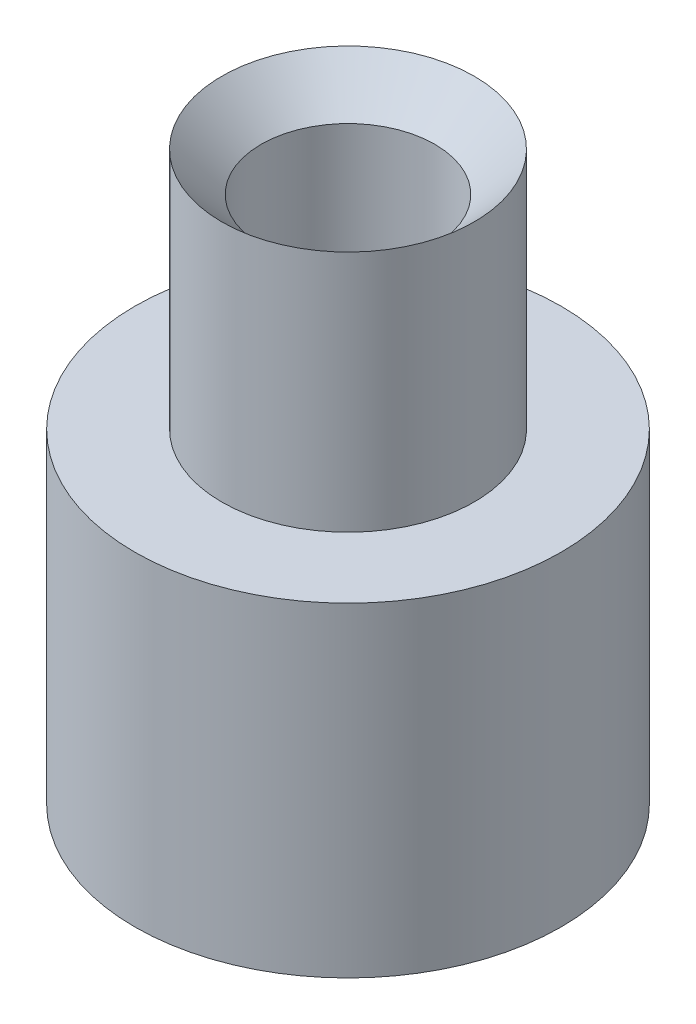
ISO-10303-21;
HEADER;
FILE_DESCRIPTION(('STEP AP214'),'2;1');
FILE_NAME('part.step','',(''),(''),'','','');
FILE_SCHEMA(('AUTOMOTIVE_DESIGN { 1 0 10303 214 1 1 1 1 }'));
ENDSEC;
DATA;
#1=APPLICATION_CONTEXT('core data for automotive mechanical design processes');
#2=APPLICATION_PROTOCOL_DEFINITION('international standard','automotive_design',2000,#1);
#3=PRODUCT_CONTEXT('',#1,'mechanical');
#4=PRODUCT('Part','Part','',(#3));
#5=PRODUCT_RELATED_PRODUCT_CATEGORY('part','',(#4));
#6=PRODUCT_DEFINITION_FORMATION('','',#4);
#7=PRODUCT_DEFINITION_CONTEXT('part definition',#1,'design');
#8=PRODUCT_DEFINITION('design','',#6,#7);
#9=PRODUCT_DEFINITION_SHAPE('','',#8);
#10=(LENGTH_UNIT() NAMED_UNIT(*) SI_UNIT(.MILLI.,.METRE.));
#11=(NAMED_UNIT(*) PLANE_ANGLE_UNIT() SI_UNIT($,.RADIAN.));
#12=(NAMED_UNIT(*) SI_UNIT($,.STERADIAN.) SOLID_ANGLE_UNIT());
#13=UNCERTAINTY_MEASURE_WITH_UNIT(LENGTH_MEASURE(1.E-05),#10,'distance_accuracy_value','');
#14=(GEOMETRIC_REPRESENTATION_CONTEXT(3) GLOBAL_UNCERTAINTY_ASSIGNED_CONTEXT((#13)) GLOBAL_UNIT_ASSIGNED_CONTEXT((#10,
#11,#12)) REPRESENTATION_CONTEXT('',''));
#15=CARTESIAN_POINT('',(0.,0.,0.));
#16=DIRECTION('',(0.,0.,1.));
#17=DIRECTION('',(1.,0.,0.));
#18=AXIS2_PLACEMENT_3D('',#15,#16,#17);
#19=CARTESIAN_POINT('',(0.,9.9,0.));
#20=DIRECTION('',(0.,1.,0.));
#21=DIRECTION('',(0.,0.,1.));
#22=AXIS2_PLACEMENT_3D('',#19,#20,#21);
#23=PLANE('',#22);
#24=CARTESIAN_POINT('',(0.,9.9,0.));
#25=DIRECTION('',(0.,1.,0.));
#26=DIRECTION('',(0.,0.,1.));
#27=AXIS2_PLACEMENT_3D('',#24,#25,#26);
#28=CIRCLE('',#27,6.5);
#29=CARTESIAN_POINT('',(0.,9.9,-6.5));
#30=VERTEX_POINT('',#29);
#31=EDGE_CURVE('E50',#30,#30,#28,.T.);
#32=ORIENTED_EDGE('',*,*,#31,.T.);
#33=EDGE_LOOP('',(#32));
#34=FACE_BOUND('',#33,.T.);
#35=CARTESIAN_POINT('',(0.,9.9,0.));
#36=DIRECTION('',(0.,1.,0.));
#37=DIRECTION('',(0.,0.,1.));
#38=AXIS2_PLACEMENT_3D('',#35,#36,#37);
#39=CIRCLE('',#38,3.85);
#40=CARTESIAN_POINT('',(0.,9.9,3.85));
#41=VERTEX_POINT('',#40);
#42=EDGE_CURVE('E65',#41,#41,#39,.T.);
#43=ORIENTED_EDGE('',*,*,#42,.F.);
#44=EDGE_LOOP('',(#43));
#45=FACE_BOUND('',#44,.T.);
#46=ADVANCED_FACE('F37',(#34,#45),#23,.T.);
#47=CARTESIAN_POINT('',(0.,0.,0.));
#48=DIRECTION('',(0.,1.,0.));
#49=DIRECTION('',(0.,0.,1.));
#50=AXIS2_PLACEMENT_3D('',#47,#48,#49);
#51=PLANE('',#50);
#52=CARTESIAN_POINT('',(0.,0.,0.));
#53=DIRECTION('',(0.,1.,0.));
#54=DIRECTION('',(0.,0.,1.));
#55=AXIS2_PLACEMENT_3D('',#52,#53,#54);
#56=CIRCLE('',#55,6.5);
#57=CARTESIAN_POINT('',(0.,0.,-6.5));
#58=VERTEX_POINT('',#57);
#59=EDGE_CURVE('E55',#58,#58,#56,.T.);
#60=ORIENTED_EDGE('',*,*,#59,.F.);
#61=EDGE_LOOP('',(#60));
#62=FACE_BOUND('',#61,.T.);
#63=CARTESIAN_POINT('',(0.,0.,0.));
#64=DIRECTION('',(0.,1.,0.));
#65=DIRECTION('',(0.,0.,1.));
#66=AXIS2_PLACEMENT_3D('',#63,#64,#65);
#67=CIRCLE('',#66,2.65);
#68=CARTESIAN_POINT('',(0.,0.,-2.65));
#69=VERTEX_POINT('',#68);
#70=EDGE_CURVE('E60',#69,#69,#67,.T.);
#71=ORIENTED_EDGE('',*,*,#70,.T.);
#72=EDGE_LOOP('',(#71));
#73=FACE_BOUND('',#72,.T.);
#74=ADVANCED_FACE('F73',(#62,#73),#51,.F.);
#75=CARTESIAN_POINT('',(0.,9.9,0.));
#76=DIRECTION('',(0.,-1.,0.));
#77=DIRECTION('',(0.,0.,-1.));
#78=AXIS2_PLACEMENT_3D('',#75,#76,#77);
#79=CYLINDRICAL_SURFACE('',#78,6.5);
#80=CARTESIAN_POINT('',(0.,9.9,-6.5));
#81=CARTESIAN_POINT('',(0.,9.796875,-6.5));
#82=CARTESIAN_POINT('',(0.,9.69375,-6.5));
#83=CARTESIAN_POINT('',(0.,9.4875,-6.5));
#84=CARTESIAN_POINT('',(0.,9.384375,-6.5));
#85=CARTESIAN_POINT('',(0.,9.178125,-6.5));
#86=CARTESIAN_POINT('',(0.,9.075,-6.5));
#87=CARTESIAN_POINT('',(0.,8.86875,-6.5));
#88=CARTESIAN_POINT('',(0.,8.765625,-6.5));
#89=CARTESIAN_POINT('',(0.,8.559375,-6.5));
#90=CARTESIAN_POINT('',(0.,8.45625,-6.5));
#91=CARTESIAN_POINT('',(0.,8.25,-6.5));
#92=CARTESIAN_POINT('',(0.,8.146875,-6.5));
#93=CARTESIAN_POINT('',(0.,7.940625,-6.5));
#94=CARTESIAN_POINT('',(0.,7.8375,-6.5));
#95=CARTESIAN_POINT('',(0.,7.63125,-6.5));
#96=CARTESIAN_POINT('',(0.,7.528125,-6.5));
#97=CARTESIAN_POINT('',(0.,7.321875,-6.5));
#98=CARTESIAN_POINT('',(0.,7.21875,-6.5));
#99=CARTESIAN_POINT('',(0.,7.0125,-6.5));
#100=CARTESIAN_POINT('',(0.,6.909375,-6.5));
#101=CARTESIAN_POINT('',(0.,6.703125,-6.5));
#102=CARTESIAN_POINT('',(0.,6.6,-6.5));
#103=CARTESIAN_POINT('',(0.,6.39375,-6.5));
#104=CARTESIAN_POINT('',(0.,6.290625,-6.5));
#105=CARTESIAN_POINT('',(0.,6.084375,-6.5));
#106=CARTESIAN_POINT('',(0.,5.98125,-6.5));
#107=CARTESIAN_POINT('',(0.,5.775,-6.5));
#108=CARTESIAN_POINT('',(0.,5.671875,-6.5));
#109=CARTESIAN_POINT('',(0.,5.465625,-6.5));
#110=CARTESIAN_POINT('',(0.,5.3625,-6.5));
#111=CARTESIAN_POINT('',(0.,5.15625,-6.5));
#112=CARTESIAN_POINT('',(0.,5.053125,-6.5));
#113=CARTESIAN_POINT('',(0.,4.846875,-6.5));
#114=CARTESIAN_POINT('',(0.,4.74375,-6.5));
#115=CARTESIAN_POINT('',(0.,4.5375,-6.5));
#116=CARTESIAN_POINT('',(0.,4.434375,-6.5));
#117=CARTESIAN_POINT('',(0.,4.228125,-6.5));
#118=CARTESIAN_POINT('',(0.,4.125,-6.5));
#119=CARTESIAN_POINT('',(0.,3.91875,-6.5));
#120=CARTESIAN_POINT('',(0.,3.815625,-6.5));
#121=CARTESIAN_POINT('',(0.,3.609375,-6.5));
#122=CARTESIAN_POINT('',(0.,3.50625,-6.5));
#123=CARTESIAN_POINT('',(0.,3.3,-6.5));
#124=CARTESIAN_POINT('',(0.,3.196875,-6.5));
#125=CARTESIAN_POINT('',(0.,2.990625,-6.5));
#126=CARTESIAN_POINT('',(0.,2.8875,-6.5));
#127=CARTESIAN_POINT('',(0.,2.68125,-6.5));
#128=CARTESIAN_POINT('',(0.,2.578125,-6.5));
#129=CARTESIAN_POINT('',(0.,2.371875,-6.5));
#130=CARTESIAN_POINT('',(0.,2.26875,-6.5));
#131=CARTESIAN_POINT('',(0.,2.0625,-6.5));
#132=CARTESIAN_POINT('',(0.,1.959375,-6.5));
#133=CARTESIAN_POINT('',(0.,1.753125,-6.5));
#134=CARTESIAN_POINT('',(0.,1.65,-6.5));
#135=CARTESIAN_POINT('',(0.,1.44375,-6.5));
#136=CARTESIAN_POINT('',(0.,1.340625,-6.5));
#137=CARTESIAN_POINT('',(0.,1.134375,-6.5));
#138=CARTESIAN_POINT('',(0.,1.03125,-6.5));
#139=CARTESIAN_POINT('',(0.,0.825,-6.5));
#140=CARTESIAN_POINT('',(0.,0.721875,-6.5));
#141=CARTESIAN_POINT('',(0.,0.515625,-6.5));
#142=CARTESIAN_POINT('',(0.,0.4125,-6.5));
#143=CARTESIAN_POINT('',(0.,0.20625,-6.5));
#144=CARTESIAN_POINT('',(0.,0.103125,-6.5));
#145=CARTESIAN_POINT('',(0.,0.,-6.5));
#146=B_SPLINE_CURVE_WITH_KNOTS('',3,(#80,#81,#82,#83,#84,#85,#86,#87,#88,#89,#90,#91,#92,#93,
#94,#95,#96,#97,#98,#99,#100,#101,#102,#103,#104,#105,#106,#107,#108,#109,#110,#111,#112,#113,
#114,#115,#116,#117,#118,#119,#120,#121,#122,#123,#124,#125,#126,#127,#128,#129,#130,#131,#132,
#133,#134,#135,#136,#137,#138,#139,#140,#141,#142,#143,#144,#145),.UNSPECIFIED.,.F.,.F.,(4,2,2,
2,2,2,2,2,2,2,2,2,2,2,2,2,2,2,2,2,2,2,2,2,2,2,2,2,2,2,2,2,4),(0.,0.309374999999999,
0.618749999999999,0.928124999999998,1.2375,1.546875,1.85625,2.165625,2.475,2.784375,3.09375,
3.403125,3.7125,4.021875,4.33125,4.640625,4.95,5.259375,5.56875,5.878125,6.1875,6.496875,
6.80625,7.115625,7.425,7.734375,8.04375,8.353125,8.6625,8.971875,9.28125,9.590625,9.9),.UNSPECIFIED.);
#147=EDGE_CURVE('BSEAM79',#30,#58,#146,.T.);
#148=ORIENTED_EDGE('',*,*,#31,.F.);
#149=ORIENTED_EDGE('',*,*,#59,.T.);
#150=ORIENTED_EDGE('',*,*,#147,.T.);
#151=ORIENTED_EDGE('',*,*,#147,.F.);
#152=EDGE_LOOP('',(#148,#150,#149,#151));
#153=FACE_BOUND('',#152,.T.);
#154=ADVANCED_FACE('F79',(#153),#79,.T.);
#155=CARTESIAN_POINT('',(0.,9.9,0.));
#156=DIRECTION('',(0.,-1.,0.));
#157=DIRECTION('',(0.,0.,-1.));
#158=AXIS2_PLACEMENT_3D('',#155,#156,#157);
#159=CYLINDRICAL_SURFACE('',#158,2.65);
#160=CARTESIAN_POINT('',(0.,16.1,0.));
#161=DIRECTION('',(0.,1.,0.));
#162=DIRECTION('',(0.,0.,1.));
#163=AXIS2_PLACEMENT_3D('',#160,#161,#162);
#164=CIRCLE('',#163,2.65);
#165=CARTESIAN_POINT('',(0.,16.1,-2.65));
#166=VERTEX_POINT('',#165);
#167=EDGE_CURVE('E45',#166,#166,#164,.T.);
#168=CARTESIAN_POINT('',(0.,16.1,-2.65));
#169=CARTESIAN_POINT('',(0.,15.9322916666666,-2.65));
#170=CARTESIAN_POINT('',(0.,15.7645833333333,-2.65));
#171=CARTESIAN_POINT('',(0.,15.4291666666666,-2.65));
#172=CARTESIAN_POINT('',(0.,15.2614583333333,-2.65));
#173=CARTESIAN_POINT('',(0.,14.9260416666666,-2.65));
#174=CARTESIAN_POINT('',(0.,14.7583333333333,-2.65));
#175=CARTESIAN_POINT('',(0.,14.4229166666666,-2.65));
#176=CARTESIAN_POINT('',(0.,14.2552083333333,-2.65));
#177=CARTESIAN_POINT('',(0.,13.9197916666666,-2.65));
#178=CARTESIAN_POINT('',(0.,13.7520833333333,-2.65));
#179=CARTESIAN_POINT('',(0.,13.4166666666666,-2.65));
#180=CARTESIAN_POINT('',(0.,13.2489583333333,-2.65));
#181=CARTESIAN_POINT('',(0.,12.9135416666666,-2.65));
#182=CARTESIAN_POINT('',(0.,12.7458333333333,-2.65));
#183=CARTESIAN_POINT('',(0.,12.4104166666666,-2.65));
#184=CARTESIAN_POINT('',(0.,12.2427083333333,-2.65));
#185=CARTESIAN_POINT('',(0.,11.9072916666666,-2.65));
#186=CARTESIAN_POINT('',(0.,11.7395833333333,-2.65));
#187=CARTESIAN_POINT('',(0.,11.4041666666667,-2.65));
#188=CARTESIAN_POINT('',(0.,11.2364583333333,-2.65));
#189=CARTESIAN_POINT('',(0.,10.9010416666667,-2.65));
#190=CARTESIAN_POINT('',(0.,10.7333333333333,-2.65));
#191=CARTESIAN_POINT('',(0.,10.3979166666667,-2.65));
#192=CARTESIAN_POINT('',(0.,10.2302083333333,-2.65));
#193=CARTESIAN_POINT('',(0.,9.89479166666665,-2.65));
#194=CARTESIAN_POINT('',(0.,9.72708333333332,-2.65));
#195=CARTESIAN_POINT('',(0.,9.39166666666665,-2.65));
#196=CARTESIAN_POINT('',(0.,9.22395833333332,-2.65));
#197=CARTESIAN_POINT('',(0.,8.88854166666665,-2.65));
#198=CARTESIAN_POINT('',(0.,8.72083333333332,-2.65));
#199=CARTESIAN_POINT('',(0.,8.38541666666665,-2.65));
#200=CARTESIAN_POINT('',(0.,8.21770833333332,-2.65));
#201=CARTESIAN_POINT('',(0.,7.88229166666665,-2.65));
#202=CARTESIAN_POINT('',(0.,7.71458333333332,-2.65));
#203=CARTESIAN_POINT('',(0.,7.37916666666665,-2.65));
#204=CARTESIAN_POINT('',(0.,7.21145833333332,-2.65));
#205=CARTESIAN_POINT('',(0.,6.87604166666666,-2.65));
#206=CARTESIAN_POINT('',(0.,6.70833333333332,-2.65));
#207=CARTESIAN_POINT('',(0.,6.37291666666666,-2.65));
#208=CARTESIAN_POINT('',(0.,6.20520833333332,-2.65));
#209=CARTESIAN_POINT('',(0.,5.86979166666666,-2.65));
#210=CARTESIAN_POINT('',(0.,5.70208333333332,-2.65));
#211=CARTESIAN_POINT('',(0.,5.36666666666666,-2.65));
#212=CARTESIAN_POINT('',(0.,5.19895833333332,-2.65));
#213=CARTESIAN_POINT('',(0.,4.86354166666666,-2.65));
#214=CARTESIAN_POINT('',(0.,4.69583333333333,-2.65));
#215=CARTESIAN_POINT('',(0.,4.36041666666666,-2.65));
#216=CARTESIAN_POINT('',(0.,4.19270833333333,-2.65));
#217=CARTESIAN_POINT('',(0.,3.85729166666666,-2.65));
#218=CARTESIAN_POINT('',(0.,3.68958333333333,-2.65));
#219=CARTESIAN_POINT('',(0.,3.35416666666666,-2.65));
#220=CARTESIAN_POINT('',(0.,3.18645833333333,-2.65));
#221=CARTESIAN_POINT('',(0.,2.85104166666666,-2.65));
#222=CARTESIAN_POINT('',(0.,2.68333333333333,-2.65));
#223=CARTESIAN_POINT('',(0.,2.34791666666666,-2.65));
#224=CARTESIAN_POINT('',(0.,2.18020833333333,-2.65));
#225=CARTESIAN_POINT('',(0.,1.84479166666666,-2.65));
#226=CARTESIAN_POINT('',(0.,1.67708333333333,-2.65));
#227=CARTESIAN_POINT('',(0.,1.34166666666666,-2.65));
#228=CARTESIAN_POINT('',(0.,1.17395833333333,-2.65));
#229=CARTESIAN_POINT('',(0.,0.838541666666664,-2.65));
#230=CARTESIAN_POINT('',(0.,0.670833333333331,-2.65));
#231=CARTESIAN_POINT('',(0.,0.335416666666665,-2.65));
#232=CARTESIAN_POINT('',(0.,0.167708333333332,-2.65));
#233=CARTESIAN_POINT('',(0.,0.,-2.65));
#234=B_SPLINE_CURVE_WITH_KNOTS('',3,(#168,#169,#170,#171,#172,#173,#174,#175,#176,#177,#178,
#179,#180,#181,#182,#183,#184,#185,#186,#187,#188,#189,#190,#191,#192,#193,#194,#195,#196,#197,
#198,#199,#200,#201,#202,#203,#204,#205,#206,#207,#208,#209,#210,#211,#212,#213,#214,#215,#216,
#217,#218,#219,#220,#221,#222,#223,#224,#225,#226,#227,#228,#229,#230,#231,#232,#233),
.UNSPECIFIED.,.F.,.F.,(4,2,2,2,2,2,2,2,2,2,2,2,2,2,2,2,2,2,2,2,2,2,2,2,2,2,2,2,2,2,2,2,4),(0.,
0.503125,1.00625,1.509375,2.0125,2.515625,3.01875,3.521875,4.025,4.528125,5.03124999999999,
5.53437499999999,6.03749999999999,6.54062499999999,7.04374999999999,7.54687499999999,
8.04999999999999,8.55312499999999,9.05624999999999,9.55937499999999,10.0625,10.565625,11.06875,
11.571875,12.075,12.578125,13.08125,13.584375,14.0875,14.590625,15.09375,15.596875,16.1),.UNSPECIFIED.);
#235=EDGE_CURVE('BSEAM83',#166,#69,#234,.T.);
#236=ORIENTED_EDGE('',*,*,#167,.T.);
#237=ORIENTED_EDGE('',*,*,#70,.F.);
#238=ORIENTED_EDGE('',*,*,#235,.T.);
#239=ORIENTED_EDGE('',*,*,#235,.F.);
#240=EDGE_LOOP('',(#236,#238,#237,#239));
#241=FACE_BOUND('',#240,.T.);
#242=ADVANCED_FACE('F83',(#241),#159,.F.);
#243=CARTESIAN_POINT('',(0.,17.4,0.));
#244=DIRECTION('',(0.,-1.,0.));
#245=DIRECTION('',(0.,0.,-1.));
#246=AXIS2_PLACEMENT_3D('',#243,#244,#245);
#247=CYLINDRICAL_SURFACE('',#246,3.85);
#248=CARTESIAN_POINT('',(0.,17.3,0.));
#249=DIRECTION('',(0.,1.,0.));
#250=DIRECTION('',(0.,0.,1.));
#251=AXIS2_PLACEMENT_3D('',#248,#249,#250);
#252=CIRCLE('',#251,3.85);
#253=CARTESIAN_POINT('',(0.,17.3,3.85));
#254=VERTEX_POINT('',#253);
#255=EDGE_CURVE('E10',#254,#254,#252,.F.);
#256=ORIENTED_EDGE('',*,*,#255,.T.);
#257=EDGE_LOOP('',(#256));
#258=FACE_BOUND('',#257,.T.);
#259=ORIENTED_EDGE('',*,*,#42,.T.);
#260=EDGE_LOOP('',(#259));
#261=FACE_BOUND('',#260,.T.);
#262=ADVANCED_FACE('F70',(#258,#261),#247,.T.);
#263=CARTESIAN_POINT('',(0.,16.1,0.));
#264=DIRECTION('',(0.,1.,0.));
#265=DIRECTION('',(0.,0.,1.));
#266=AXIS2_PLACEMENT_3D('',#263,#264,#265);
#267=CONICAL_SURFACE('',#266,2.65,0.785398163397444);
#268=ORIENTED_EDGE('',*,*,#255,.F.);
#269=EDGE_LOOP('',(#268));
#270=FACE_BOUND('',#269,.T.);
#271=ORIENTED_EDGE('',*,*,#167,.F.);
#272=EDGE_LOOP('',(#271));
#273=FACE_BOUND('',#272,.T.);
#274=ADVANCED_FACE('F39',(#270,#273),#267,.F.);
#275=CLOSED_SHELL('',(#46,#74,#154,#242,#262,#274));
#276=MANIFOLD_SOLID_BREP('B2',#275);
#277=ADVANCED_BREP_SHAPE_REPRESENTATION('',(#18,#276),#14);
#278=SHAPE_DEFINITION_REPRESENTATION(#9,#277);
ENDSEC;
END-ISO-10303-21;
